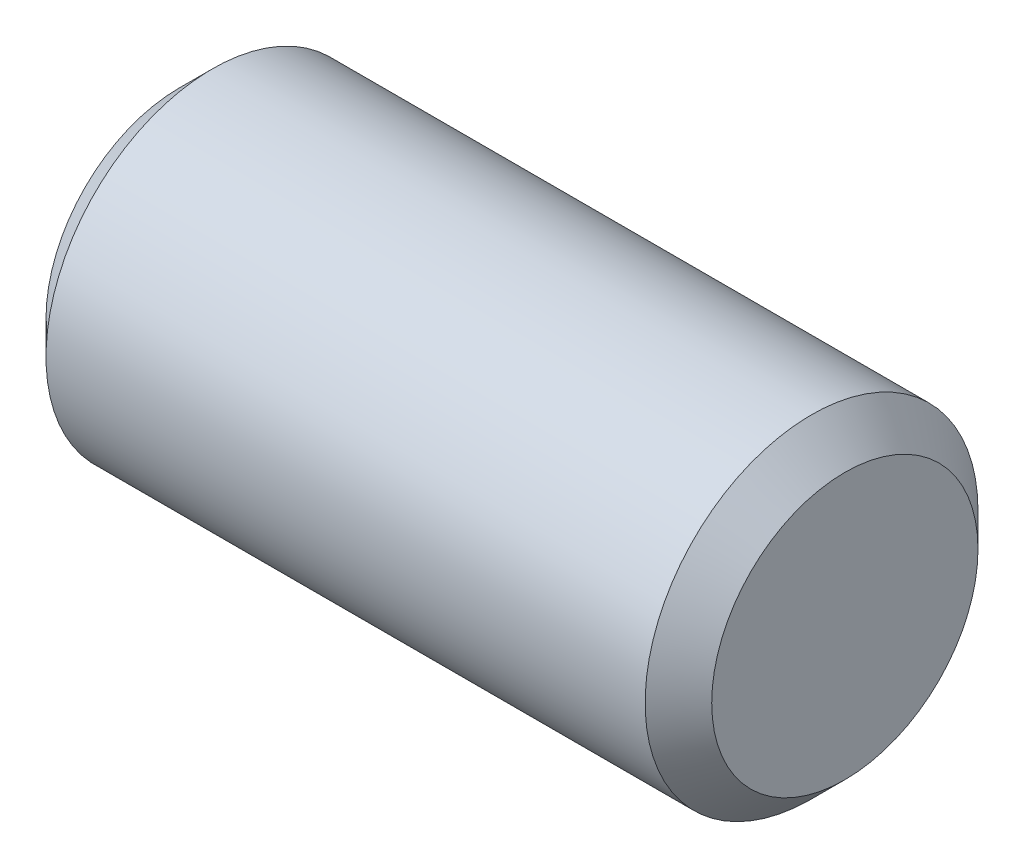
ISO-10303-21;
HEADER;
FILE_DESCRIPTION(('STEP AP214'),'2;1');
FILE_NAME('part.step','',(''),(''),'','','');
FILE_SCHEMA(('AUTOMOTIVE_DESIGN { 1 0 10303 214 1 1 1 1 }'));
ENDSEC;
DATA;
#1=APPLICATION_CONTEXT('core data for automotive mechanical design processes');
#2=APPLICATION_PROTOCOL_DEFINITION('international standard','automotive_design',2000,#1);
#3=PRODUCT_CONTEXT('',#1,'mechanical');
#4=PRODUCT('Part','Part','',(#3));
#5=PRODUCT_RELATED_PRODUCT_CATEGORY('part','',(#4));
#6=PRODUCT_DEFINITION_FORMATION('','',#4);
#7=PRODUCT_DEFINITION_CONTEXT('part definition',#1,'design');
#8=PRODUCT_DEFINITION('design','',#6,#7);
#9=PRODUCT_DEFINITION_SHAPE('','',#8);
#10=(LENGTH_UNIT() NAMED_UNIT(*) SI_UNIT(.MILLI.,.METRE.));
#11=(NAMED_UNIT(*) PLANE_ANGLE_UNIT() SI_UNIT($,.RADIAN.));
#12=(NAMED_UNIT(*) SI_UNIT($,.STERADIAN.) SOLID_ANGLE_UNIT());
#13=UNCERTAINTY_MEASURE_WITH_UNIT(LENGTH_MEASURE(1.E-05),#10,'distance_accuracy_value','');
#14=(GEOMETRIC_REPRESENTATION_CONTEXT(3) GLOBAL_UNCERTAINTY_ASSIGNED_CONTEXT((#13)) GLOBAL_UNIT_ASSIGNED_CONTEXT((#10,
#11,#12)) REPRESENTATION_CONTEXT('',''));
#15=CARTESIAN_POINT('',(0.,0.,0.));
#16=DIRECTION('',(0.,0.,1.));
#17=DIRECTION('',(1.,0.,0.));
#18=AXIS2_PLACEMENT_3D('',#15,#16,#17);
#19=CARTESIAN_POINT('',(-4.7625,0.,0.));
#20=DIRECTION('',(1.,0.,0.));
#21=DIRECTION('',(0.,0.,-1.));
#22=AXIS2_PLACEMENT_3D('',#19,#20,#21);
#23=CYLINDRICAL_SURFACE('',#22,2.38125);
#24=CARTESIAN_POINT('',(4.28625,0.,0.));
#25=DIRECTION('',(1.,0.,0.));
#26=DIRECTION('',(0.,0.,-1.));
#27=AXIS2_PLACEMENT_3D('',#24,#25,#26);
#28=CIRCLE('',#27,2.38125);
#29=CARTESIAN_POINT('',(4.28625,0.,-2.38125));
#30=VERTEX_POINT('',#29);
#31=EDGE_CURVE('E39',#30,#30,#28,.F.);
#32=ORIENTED_EDGE('',*,*,#31,.T.);
#33=EDGE_LOOP('',(#32));
#34=FACE_BOUND('',#33,.T.);
#35=CARTESIAN_POINT('',(-4.28625000000001,0.,0.));
#36=DIRECTION('',(1.,0.,0.));
#37=DIRECTION('',(0.,0.,-1.));
#38=AXIS2_PLACEMENT_3D('',#35,#36,#37);
#39=CIRCLE('',#38,2.38125);
#40=CARTESIAN_POINT('',(-4.28625000000001,0.,-2.38125));
#41=VERTEX_POINT('',#40);
#42=EDGE_CURVE('E43',#41,#41,#39,.T.);
#43=ORIENTED_EDGE('',*,*,#42,.T.);
#44=EDGE_LOOP('',(#43));
#45=FACE_BOUND('',#44,.T.);
#46=ADVANCED_FACE('F32',(#34,#45),#23,.T.);
#47=CARTESIAN_POINT('',(-4.7625,0.,0.));
#48=DIRECTION('',(1.,0.,0.));
#49=DIRECTION('',(0.,0.,-1.));
#50=AXIS2_PLACEMENT_3D('',#47,#48,#49);
#51=PLANE('',#50);
#52=CARTESIAN_POINT('',(-4.7625,0.,0.));
#53=DIRECTION('',(1.,0.,0.));
#54=DIRECTION('',(0.,0.,-1.));
#55=AXIS2_PLACEMENT_3D('',#52,#53,#54);
#56=CIRCLE('',#55,1.905);
#57=CARTESIAN_POINT('',(-4.7625,0.,-1.905));
#58=VERTEX_POINT('',#57);
#59=EDGE_CURVE('E10',#58,#58,#56,.F.);
#60=ORIENTED_EDGE('',*,*,#59,.T.);
#61=EDGE_LOOP('',(#60));
#62=FACE_BOUND('',#61,.T.);
#63=ADVANCED_FACE('F63',(#62),#51,.F.);
#64=CARTESIAN_POINT('',(4.7625,0.,0.));
#65=DIRECTION('',(1.,0.,0.));
#66=DIRECTION('',(0.,0.,-1.));
#67=AXIS2_PLACEMENT_3D('',#64,#65,#66);
#68=PLANE('',#67);
#69=CARTESIAN_POINT('',(4.7625,0.,0.));
#70=DIRECTION('',(1.,0.,0.));
#71=DIRECTION('',(0.,0.,-1.));
#72=AXIS2_PLACEMENT_3D('',#69,#70,#71);
#73=CIRCLE('',#72,1.905);
#74=CARTESIAN_POINT('',(4.7625,0.,-1.905));
#75=VERTEX_POINT('',#74);
#76=EDGE_CURVE('E47',#75,#75,#73,.T.);
#77=ORIENTED_EDGE('',*,*,#76,.T.);
#78=EDGE_LOOP('',(#77));
#79=FACE_BOUND('',#78,.T.);
#80=ADVANCED_FACE('F53',(#79),#68,.T.);
#81=CARTESIAN_POINT('',(4.7625,0.,0.));
#82=DIRECTION('',(-1.,0.,0.));
#83=DIRECTION('',(0.,0.,1.));
#84=AXIS2_PLACEMENT_3D('',#81,#82,#83);
#85=CONICAL_SURFACE('',#84,1.905,0.785398163397445);
#86=ORIENTED_EDGE('',*,*,#31,.F.);
#87=EDGE_LOOP('',(#86));
#88=FACE_BOUND('',#87,.T.);
#89=ORIENTED_EDGE('',*,*,#76,.F.);
#90=EDGE_LOOP('',(#89));
#91=FACE_BOUND('',#90,.T.);
#92=ADVANCED_FACE('F55',(#88,#91),#85,.T.);
#93=CARTESIAN_POINT('',(-4.28625000000001,0.,0.));
#94=DIRECTION('',(1.,0.,0.));
#95=DIRECTION('',(0.,0.,-1.));
#96=AXIS2_PLACEMENT_3D('',#93,#94,#95);
#97=CONICAL_SURFACE('',#96,2.38125,0.785398163397451);
#98=ORIENTED_EDGE('',*,*,#59,.F.);
#99=EDGE_LOOP('',(#98));
#100=FACE_BOUND('',#99,.T.);
#101=ORIENTED_EDGE('',*,*,#42,.F.);
#102=EDGE_LOOP('',(#101));
#103=FACE_BOUND('',#102,.T.);
#104=ADVANCED_FACE('F34',(#100,#103),#97,.T.);
#105=CLOSED_SHELL('',(#46,#63,#80,#92,#104));
#106=MANIFOLD_SOLID_BREP('B2',#105);
#107=ADVANCED_BREP_SHAPE_REPRESENTATION('',(#18,#106),#14);
#108=SHAPE_DEFINITION_REPRESENTATION(#9,#107);
ENDSEC;
END-ISO-10303-21;
